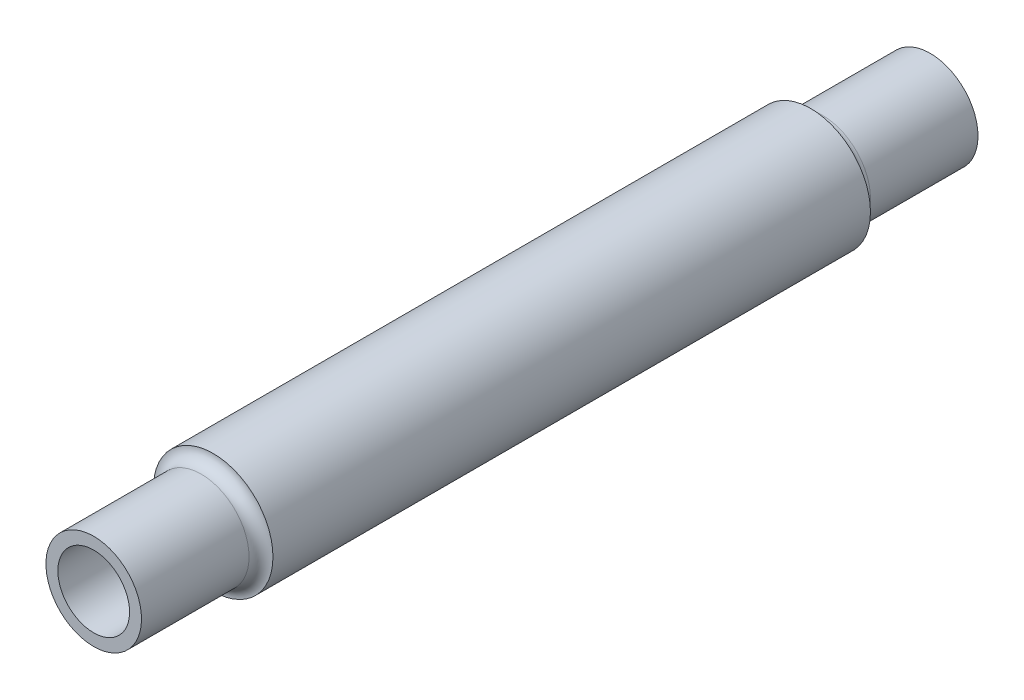
ISO-10303-21;
HEADER;
FILE_DESCRIPTION(('STEP AP214'),'2;1');
FILE_NAME('part.step','',(''),(''),'','','');
FILE_SCHEMA(('AUTOMOTIVE_DESIGN { 1 0 10303 214 1 1 1 1 }'));
ENDSEC;
DATA;
#1=APPLICATION_CONTEXT('core data for automotive mechanical design processes');
#2=APPLICATION_PROTOCOL_DEFINITION('international standard','automotive_design',2000,#1);
#3=PRODUCT_CONTEXT('',#1,'mechanical');
#4=PRODUCT('Part','Part','',(#3));
#5=PRODUCT_RELATED_PRODUCT_CATEGORY('part','',(#4));
#6=PRODUCT_DEFINITION_FORMATION('','',#4);
#7=PRODUCT_DEFINITION_CONTEXT('part definition',#1,'design');
#8=PRODUCT_DEFINITION('design','',#6,#7);
#9=PRODUCT_DEFINITION_SHAPE('','',#8);
#10=(LENGTH_UNIT() NAMED_UNIT(*) SI_UNIT(.MILLI.,.METRE.));
#11=(NAMED_UNIT(*) PLANE_ANGLE_UNIT() SI_UNIT($,.RADIAN.));
#12=(NAMED_UNIT(*) SI_UNIT($,.STERADIAN.) SOLID_ANGLE_UNIT());
#13=UNCERTAINTY_MEASURE_WITH_UNIT(LENGTH_MEASURE(1.E-05),#10,'distance_accuracy_value','');
#14=(GEOMETRIC_REPRESENTATION_CONTEXT(3) GLOBAL_UNCERTAINTY_ASSIGNED_CONTEXT((#13)) GLOBAL_UNIT_ASSIGNED_CONTEXT((#10,
#11,#12)) REPRESENTATION_CONTEXT('',''));
#15=CARTESIAN_POINT('',(0.,0.,0.));
#16=DIRECTION('',(0.,0.,1.));
#17=DIRECTION('',(1.,0.,0.));
#18=AXIS2_PLACEMENT_3D('',#15,#16,#17);
#19=CARTESIAN_POINT('',(0.,0.,-88.9));
#20=DIRECTION('',(0.,0.,-1.));
#21=DIRECTION('',(1.,0.,0.));
#22=AXIS2_PLACEMENT_3D('',#19,#20,#21);
#23=PLANE('',#22);
#24=CARTESIAN_POINT('',(0.,0.,-88.9));
#25=DIRECTION('',(0.,0.,1.));
#26=DIRECTION('',(1.,0.,0.));
#27=AXIS2_PLACEMENT_3D('',#24,#25,#26);
#28=CIRCLE('',#27,10.16);
#29=CARTESIAN_POINT('',(10.16,0.,-88.9));
#30=VERTEX_POINT('',#29);
#31=EDGE_CURVE('E46',#30,#30,#28,.T.);
#32=ORIENTED_EDGE('',*,*,#31,.F.);
#33=EDGE_LOOP('',(#32));
#34=FACE_BOUND('',#33,.T.);
#35=CARTESIAN_POINT('',(0.,0.,-88.9));
#36=DIRECTION('',(0.,0.,-1.));
#37=DIRECTION('',(-1.,0.,0.));
#38=AXIS2_PLACEMENT_3D('',#35,#36,#37);
#39=CIRCLE('',#38,7.62);
#40=CARTESIAN_POINT('',(-7.62,0.,-88.9));
#41=VERTEX_POINT('',#40);
#42=EDGE_CURVE('E58',#41,#41,#39,.F.);
#43=ORIENTED_EDGE('',*,*,#42,.T.);
#44=EDGE_LOOP('',(#43));
#45=FACE_BOUND('',#44,.T.);
#46=ADVANCED_FACE('F31',(#34,#45),#23,.T.);
#47=CARTESIAN_POINT('',(0.,0.,63.5));
#48=DIRECTION('',(0.,0.,-1.));
#49=DIRECTION('',(-1.,0.,0.));
#50=AXIS2_PLACEMENT_3D('',#47,#48,#49);
#51=CYLINDRICAL_SURFACE('',#50,12.7);
#52=CARTESIAN_POINT('',(0.,0.,63.5));
#53=DIRECTION('',(0.,0.,1.));
#54=DIRECTION('',(1.,0.,0.));
#55=AXIS2_PLACEMENT_3D('',#52,#53,#54);
#56=CIRCLE('',#55,12.7);
#57=CARTESIAN_POINT('',(12.7,0.,63.5));
#58=VERTEX_POINT('',#57);
#59=EDGE_CURVE('E38',#58,#58,#56,.T.);
#60=ORIENTED_EDGE('',*,*,#59,.F.);
#61=EDGE_LOOP('',(#60));
#62=FACE_BOUND('',#61,.T.);
#63=CARTESIAN_POINT('',(0.,0.,-63.5));
#64=DIRECTION('',(0.,0.,1.));
#65=DIRECTION('',(1.,0.,0.));
#66=AXIS2_PLACEMENT_3D('',#63,#64,#65);
#67=CIRCLE('',#66,12.7);
#68=CARTESIAN_POINT('',(12.7,0.,-63.5));
#69=VERTEX_POINT('',#68);
#70=EDGE_CURVE('E54',#69,#69,#67,.T.);
#71=ORIENTED_EDGE('',*,*,#70,.T.);
#72=EDGE_LOOP('',(#71));
#73=FACE_BOUND('',#72,.T.);
#74=ADVANCED_FACE('F100',(#62,#73),#51,.T.);
#75=CARTESIAN_POINT('',(0.,0.,88.9));
#76=DIRECTION('',(0.,0.,-1.));
#77=DIRECTION('',(-1.,0.,0.));
#78=AXIS2_PLACEMENT_3D('',#75,#76,#77);
#79=CYLINDRICAL_SURFACE('',#78,10.16);
#80=CARTESIAN_POINT('',(0.,0.,66.04));
#81=DIRECTION('',(0.,0.,1.));
#82=DIRECTION('',(1.,0.,0.));
#83=AXIS2_PLACEMENT_3D('',#80,#81,#82);
#84=CIRCLE('',#83,10.16);
#85=CARTESIAN_POINT('',(10.16,0.,66.04));
#86=VERTEX_POINT('',#85);
#87=EDGE_CURVE('E10',#86,#86,#84,.T.);
#88=ORIENTED_EDGE('',*,*,#87,.T.);
#89=EDGE_LOOP('',(#88));
#90=FACE_BOUND('',#89,.T.);
#91=CARTESIAN_POINT('',(0.,0.,88.9));
#92=DIRECTION('',(0.,0.,1.));
#93=DIRECTION('',(1.,0.,0.));
#94=AXIS2_PLACEMENT_3D('',#91,#92,#93);
#95=CIRCLE('',#94,10.16);
#96=CARTESIAN_POINT('',(10.16,0.,88.9));
#97=VERTEX_POINT('',#96);
#98=EDGE_CURVE('E42',#97,#97,#95,.T.);
#99=ORIENTED_EDGE('',*,*,#98,.F.);
#100=EDGE_LOOP('',(#99));
#101=FACE_BOUND('',#100,.T.);
#102=ADVANCED_FACE('F95',(#90,#101),#79,.T.);
#103=CARTESIAN_POINT('',(0.,0.,88.9));
#104=DIRECTION('',(0.,0.,1.));
#105=DIRECTION('',(1.,0.,0.));
#106=AXIS2_PLACEMENT_3D('',#103,#104,#105);
#107=PLANE('',#106);
#108=CARTESIAN_POINT('',(0.,0.,88.9));
#109=DIRECTION('',(0.,0.,1.));
#110=DIRECTION('',(1.,0.,0.));
#111=AXIS2_PLACEMENT_3D('',#108,#109,#110);
#112=CIRCLE('',#111,7.62);
#113=CARTESIAN_POINT('',(7.62,0.,88.9));
#114=VERTEX_POINT('',#113);
#115=EDGE_CURVE('E61',#114,#114,#112,.T.);
#116=ORIENTED_EDGE('',*,*,#115,.F.);
#117=EDGE_LOOP('',(#116));
#118=FACE_BOUND('',#117,.T.);
#119=ORIENTED_EDGE('',*,*,#98,.T.);
#120=EDGE_LOOP('',(#119));
#121=FACE_BOUND('',#120,.T.);
#122=ADVANCED_FACE('F92',(#118,#121),#107,.T.);
#123=CARTESIAN_POINT('',(0.,0.,66.04));
#124=DIRECTION('',(0.,0.,1.));
#125=DIRECTION('',(1.,0.,0.));
#126=AXIS2_PLACEMENT_3D('',#123,#124,#125);
#127=TOROIDAL_SURFACE('',#126,12.7,2.54);
#128=ORIENTED_EDGE('',*,*,#59,.T.);
#129=EDGE_LOOP('',(#128));
#130=FACE_BOUND('',#129,.T.);
#131=ORIENTED_EDGE('',*,*,#87,.F.);
#132=EDGE_LOOP('',(#131));
#133=FACE_BOUND('',#132,.T.);
#134=ADVANCED_FACE('F33',(#130,#133),#127,.F.);
#135=CARTESIAN_POINT('',(0.,0.,-88.9));
#136=DIRECTION('',(0.,0.,1.));
#137=DIRECTION('',(-1.,0.,0.));
#138=AXIS2_PLACEMENT_3D('',#135,#136,#137);
#139=CYLINDRICAL_SURFACE('',#138,10.16);
#140=CARTESIAN_POINT('',(0.,0.,-66.04));
#141=DIRECTION('',(0.,0.,1.));
#142=DIRECTION('',(1.,0.,0.));
#143=AXIS2_PLACEMENT_3D('',#140,#141,#142);
#144=CIRCLE('',#143,10.16);
#145=CARTESIAN_POINT('',(10.16,0.,-66.04));
#146=VERTEX_POINT('',#145);
#147=EDGE_CURVE('E51',#146,#146,#144,.T.);
#148=ORIENTED_EDGE('',*,*,#147,.F.);
#149=EDGE_LOOP('',(#148));
#150=FACE_BOUND('',#149,.T.);
#151=ORIENTED_EDGE('',*,*,#31,.T.);
#152=EDGE_LOOP('',(#151));
#153=FACE_BOUND('',#152,.T.);
#154=ADVANCED_FACE('F114',(#150,#153),#139,.T.);
#155=CARTESIAN_POINT('',(0.,0.,-66.04));
#156=DIRECTION('',(0.,0.,-1.));
#157=DIRECTION('',(1.,0.,0.));
#158=AXIS2_PLACEMENT_3D('',#155,#156,#157);
#159=TOROIDAL_SURFACE('',#158,12.7,2.54);
#160=ORIENTED_EDGE('',*,*,#70,.F.);
#161=EDGE_LOOP('',(#160));
#162=FACE_BOUND('',#161,.T.);
#163=ORIENTED_EDGE('',*,*,#147,.T.);
#164=EDGE_LOOP('',(#163));
#165=FACE_BOUND('',#164,.T.);
#166=ADVANCED_FACE('F117',(#162,#165),#159,.F.);
#167=CARTESIAN_POINT('',(0.,0.,63.5));
#168=DIRECTION('',(0.,0.,-1.));
#169=DIRECTION('',(-1.,0.,0.));
#170=AXIS2_PLACEMENT_3D('',#167,#168,#169);
#171=CYLINDRICAL_SURFACE('',#170,10.16);
#172=CARTESIAN_POINT('',(0.,0.,61.6405909487751));
#173=DIRECTION('',(0.,0.,1.));
#174=DIRECTION('',(1.,0.,0.));
#175=AXIS2_PLACEMENT_3D('',#172,#173,#174);
#176=CIRCLE('',#175,10.16);
#177=CARTESIAN_POINT('',(10.16,0.,61.6405909487751));
#178=VERTEX_POINT('',#177);
#179=EDGE_CURVE('E65',#178,#178,#176,.T.);
#180=ORIENTED_EDGE('',*,*,#179,.T.);
#181=EDGE_LOOP('',(#180));
#182=FACE_BOUND('',#181,.T.);
#183=CARTESIAN_POINT('',(0.,0.,-61.6405909487751));
#184=DIRECTION('',(0.,0.,-1.));
#185=DIRECTION('',(-1.,0.,0.));
#186=AXIS2_PLACEMENT_3D('',#183,#184,#185);
#187=CIRCLE('',#186,10.16);
#188=CARTESIAN_POINT('',(-10.16,0.,-61.6405909487751));
#189=VERTEX_POINT('',#188);
#190=EDGE_CURVE('E68',#189,#189,#187,.F.);
#191=ORIENTED_EDGE('',*,*,#190,.F.);
#192=EDGE_LOOP('',(#191));
#193=FACE_BOUND('',#192,.T.);
#194=ADVANCED_FACE('F76',(#182,#193),#171,.F.);
#195=CARTESIAN_POINT('',(0.,0.,88.9));
#196=DIRECTION('',(0.,0.,-1.));
#197=DIRECTION('',(-1.,0.,0.));
#198=AXIS2_PLACEMENT_3D('',#195,#196,#197);
#199=CYLINDRICAL_SURFACE('',#198,7.62);
#200=CARTESIAN_POINT('',(0.,0.,66.04));
#201=DIRECTION('',(0.,0.,-1.));
#202=DIRECTION('',(-1.,0.,0.));
#203=AXIS2_PLACEMENT_3D('',#200,#201,#202);
#204=CIRCLE('',#203,7.62);
#205=CARTESIAN_POINT('',(-7.62,0.,66.04));
#206=VERTEX_POINT('',#205);
#207=EDGE_CURVE('E57',#206,#206,#204,.F.);
#208=ORIENTED_EDGE('',*,*,#207,.F.);
#209=EDGE_LOOP('',(#208));
#210=FACE_BOUND('',#209,.T.);
#211=ORIENTED_EDGE('',*,*,#115,.T.);
#212=EDGE_LOOP('',(#211));
#213=FACE_BOUND('',#212,.T.);
#214=ADVANCED_FACE('F83',(#210,#213),#199,.F.);
#215=CARTESIAN_POINT('',(0.,0.,66.04));
#216=DIRECTION('',(0.,0.,1.));
#217=DIRECTION('',(1.,0.,0.));
#218=AXIS2_PLACEMENT_3D('',#215,#216,#217);
#219=TOROIDAL_SURFACE('',#218,12.7,5.08);
#220=ORIENTED_EDGE('',*,*,#179,.F.);
#221=EDGE_LOOP('',(#220));
#222=FACE_BOUND('',#221,.T.);
#223=ORIENTED_EDGE('',*,*,#207,.T.);
#224=EDGE_LOOP('',(#223));
#225=FACE_BOUND('',#224,.T.);
#226=ADVANCED_FACE('F79',(#222,#225),#219,.T.);
#227=CARTESIAN_POINT('',(0.,0.,-88.9));
#228=DIRECTION('',(0.,0.,1.));
#229=DIRECTION('',(-1.,0.,0.));
#230=AXIS2_PLACEMENT_3D('',#227,#228,#229);
#231=CYLINDRICAL_SURFACE('',#230,7.62);
#232=CARTESIAN_POINT('',(0.,0.,-66.04));
#233=DIRECTION('',(0.,0.,-1.));
#234=DIRECTION('',(-1.,0.,0.));
#235=AXIS2_PLACEMENT_3D('',#232,#233,#234);
#236=CIRCLE('',#235,7.62);
#237=CARTESIAN_POINT('',(-7.62,0.,-66.04));
#238=VERTEX_POINT('',#237);
#239=EDGE_CURVE('E62',#238,#238,#236,.F.);
#240=ORIENTED_EDGE('',*,*,#239,.T.);
#241=EDGE_LOOP('',(#240));
#242=FACE_BOUND('',#241,.T.);
#243=ORIENTED_EDGE('',*,*,#42,.F.);
#244=EDGE_LOOP('',(#243));
#245=FACE_BOUND('',#244,.T.);
#246=ADVANCED_FACE('F82',(#242,#245),#231,.F.);
#247=CARTESIAN_POINT('',(0.,0.,-66.04));
#248=DIRECTION('',(0.,0.,-1.));
#249=DIRECTION('',(1.,0.,0.));
#250=AXIS2_PLACEMENT_3D('',#247,#248,#249);
#251=TOROIDAL_SURFACE('',#250,12.7,5.08);
#252=ORIENTED_EDGE('',*,*,#190,.T.);
#253=EDGE_LOOP('',(#252));
#254=FACE_BOUND('',#253,.T.);
#255=ORIENTED_EDGE('',*,*,#239,.F.);
#256=EDGE_LOOP('',(#255));
#257=FACE_BOUND('',#256,.T.);
#258=ADVANCED_FACE('F122',(#254,#257),#251,.T.);
#259=CLOSED_SHELL('',(#46,#74,#102,#122,#134,#154,#166,#194,#214,#226,#246,#258));
#260=MANIFOLD_SOLID_BREP('B2',#259);
#261=ADVANCED_BREP_SHAPE_REPRESENTATION('',(#18,#260),#14);
#262=SHAPE_DEFINITION_REPRESENTATION(#9,#261);
ENDSEC;
END-ISO-10303-21;
